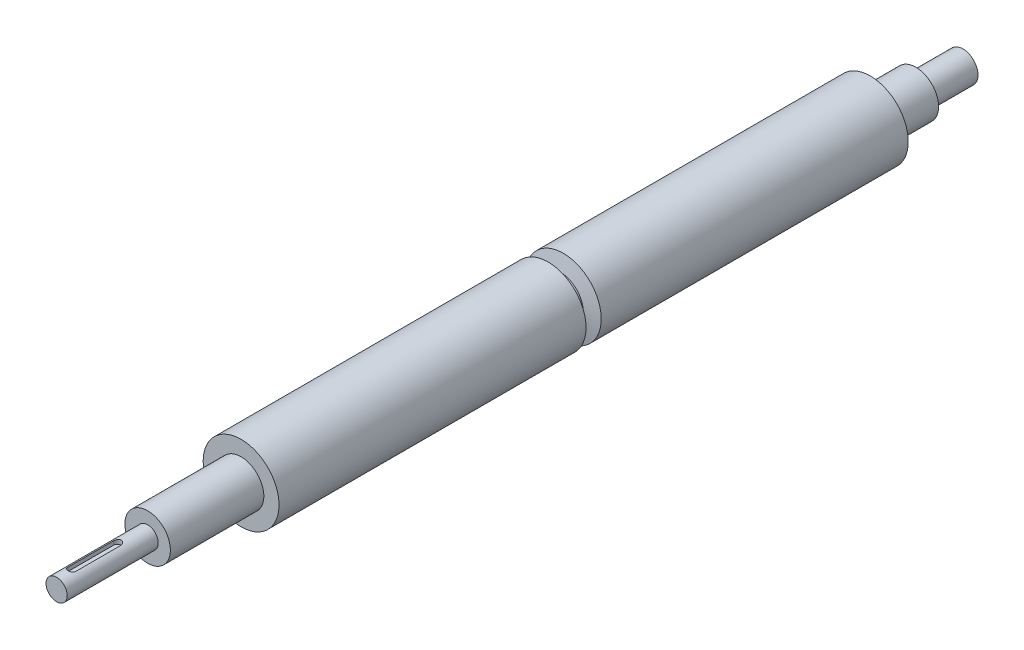
ISO-10303-21;
HEADER;
FILE_DESCRIPTION(('STEP AP214'),'2;1');
FILE_NAME('part.step','',(''),(''),'','','');
FILE_SCHEMA(('AUTOMOTIVE_DESIGN { 1 0 10303 214 1 1 1 1 }'));
ENDSEC;
DATA;
#1=APPLICATION_CONTEXT('core data for automotive mechanical design processes');
#2=APPLICATION_PROTOCOL_DEFINITION('international standard','automotive_design',2000,#1);
#3=PRODUCT_CONTEXT('',#1,'mechanical');
#4=PRODUCT('Part','Part','',(#3));
#5=PRODUCT_RELATED_PRODUCT_CATEGORY('part','',(#4));
#6=PRODUCT_DEFINITION_FORMATION('','',#4);
#7=PRODUCT_DEFINITION_CONTEXT('part definition',#1,'design');
#8=PRODUCT_DEFINITION('design','',#6,#7);
#9=PRODUCT_DEFINITION_SHAPE('','',#8);
#10=(LENGTH_UNIT() NAMED_UNIT(*) SI_UNIT(.MILLI.,.METRE.));
#11=(NAMED_UNIT(*) PLANE_ANGLE_UNIT() SI_UNIT($,.RADIAN.));
#12=(NAMED_UNIT(*) SI_UNIT($,.STERADIAN.) SOLID_ANGLE_UNIT());
#13=UNCERTAINTY_MEASURE_WITH_UNIT(LENGTH_MEASURE(1.E-05),#10,'distance_accuracy_value','');
#14=(GEOMETRIC_REPRESENTATION_CONTEXT(3) GLOBAL_UNCERTAINTY_ASSIGNED_CONTEXT((#13)) GLOBAL_UNIT_ASSIGNED_CONTEXT((#10,
#11,#12)) REPRESENTATION_CONTEXT('',''));
#15=CARTESIAN_POINT('',(0.,0.,0.));
#16=DIRECTION('',(0.,0.,1.));
#17=DIRECTION('',(1.,0.,0.));
#18=AXIS2_PLACEMENT_3D('',#15,#16,#17);
#19=CARTESIAN_POINT('',(0.,0.,-476.4));
#20=DIRECTION('',(0.,0.,1.));
#21=DIRECTION('',(1.,0.,0.));
#22=AXIS2_PLACEMENT_3D('',#19,#20,#21);
#23=CYLINDRICAL_SURFACE('',#22,25.);
#24=CARTESIAN_POINT('',(0.,0.,-264.));
#25=DIRECTION('',(0.,0.,1.));
#26=DIRECTION('',(1.,0.,0.));
#27=AXIS2_PLACEMENT_3D('',#24,#25,#26);
#28=CIRCLE('',#27,25.);
#29=CARTESIAN_POINT('',(25.,0.,-264.));
#30=VERTEX_POINT('',#29);
#31=EDGE_CURVE('E211',#30,#30,#28,.T.);
#32=ORIENTED_EDGE('',*,*,#31,.T.);
#33=EDGE_LOOP('',(#32));
#34=FACE_BOUND('',#33,.T.);
#35=CARTESIAN_POINT('',(0.,0.,-61.6));
#36=DIRECTION('',(0.,0.,-1.));
#37=DIRECTION('',(-1.,0.,0.));
#38=AXIS2_PLACEMENT_3D('',#35,#36,#37);
#39=CIRCLE('',#38,25.);
#40=CARTESIAN_POINT('',(-25.,0.,-61.6));
#41=VERTEX_POINT('',#40);
#42=EDGE_CURVE('E118',#41,#41,#39,.T.);
#43=ORIENTED_EDGE('',*,*,#42,.T.);
#44=EDGE_LOOP('',(#43));
#45=FACE_BOUND('',#44,.T.);
#46=ADVANCED_FACE('F33',(#34,#45),#23,.T.);
#47=CARTESIAN_POINT('',(0.,0.,60.));
#48=DIRECTION('',(0.,0.,-1.));
#49=DIRECTION('',(-1.,0.,0.));
#50=AXIS2_PLACEMENT_3D('',#47,#48,#49);
#51=CYLINDRICAL_SURFACE('',#50,7.);
#52=DIRECTION('',(0.,0.,-1.));
#53=VECTOR('',#52,1.);
#54=CARTESIAN_POINT('',(-2.5,6.53834841531101,60.));
#55=LINE('',#54,#53);
#56=CARTESIAN_POINT('',(-2.5,6.53834841531101,50.));
#57=VERTEX_POINT('',#56);
#58=CARTESIAN_POINT('',(-2.5,6.53834841531101,20.));
#59=VERTEX_POINT('',#58);
#60=EDGE_CURVE('E11',#57,#59,#55,.T.);
#61=ORIENTED_EDGE('',*,*,#60,.T.);
#62=CARTESIAN_POINT('',(-2.5,6.53834841531101,20.));
#63=CARTESIAN_POINT('',(-2.50000932220903,6.53833653785133,19.9321107542711));
#64=CARTESIAN_POINT('',(-2.49723485076694,6.53940549922738,19.8642280673609));
#65=CARTESIAN_POINT('',(-2.4861910211816,6.54361657478134,19.7289960893886));
#66=CARTESIAN_POINT('',(-2.47792334551208,6.54675805418062,19.6616466413939));
#67=CARTESIAN_POINT('',(-2.456001752859,6.55501217637942,19.5281785853972));
#68=CARTESIAN_POINT('',(-2.44236559963955,6.56011831705676,19.4620566636602));
#69=CARTESIAN_POINT('',(-2.40985115466648,6.57213177854175,19.3312981648915));
#70=CARTESIAN_POINT('',(-2.39097263107435,6.57903917900746,19.2666616536876));
#71=CARTESIAN_POINT('',(-2.32673964179205,6.6021493436571,19.0757356335225));
#72=CARTESIAN_POINT('',(-2.27375112606986,6.62075475340845,18.9522095478644));
#73=CARTESIAN_POINT('',(-2.14910757865425,6.6622539736071,18.715769666872));
#74=CARTESIAN_POINT('',(-2.07743895048849,6.68515090424876,18.6028636832645));
#75=CARTESIAN_POINT('',(-1.9140257110197,6.73379913792224,18.3857847866473));
#76=CARTESIAN_POINT('',(-1.82158337146743,6.75962864041371,18.2821535248041));
#77=CARTESIAN_POINT('',(-1.6207338877633,6.81057592323031,18.0914912952836));
#78=CARTESIAN_POINT('',(-1.51232377552673,6.83569357019868,18.0044634207566));
#79=CARTESIAN_POINT('',(-1.27853915335934,6.88331133279046,17.846910144545));
#80=CARTESIAN_POINT('',(-1.15274833789185,6.90570835223797,17.7769684781395));
#81=CARTESIAN_POINT('',(-0.890250825476634,6.94442357672633,17.6594633532026));
#82=CARTESIAN_POINT('',(-0.753547890540327,6.96074386585466,17.611892220954));
#83=CARTESIAN_POINT('',(-0.478829979256175,6.98491050510711,17.5423593978176));
#84=CARTESIAN_POINT('',(-0.341079835227467,6.99306594352515,17.5194608695289));
#85=CARTESIAN_POINT('',(-0.0634643052969047,7.00108798053822,17.4969315972224));
#86=CARTESIAN_POINT('',(0.0764004845074471,7.00095687302702,17.4972944139653));
#87=CARTESIAN_POINT('',(0.347593258486945,6.99262258049077,17.5207112737611));
#88=CARTESIAN_POINT('',(0.47902240707872,6.98478243583517,17.5427447941985));
#89=CARTESIAN_POINT('',(0.736175812143607,6.96237832507347,17.6071734241588));
#90=CARTESIAN_POINT('',(0.861899745780463,6.94781397899037,17.6495696843625));
#91=CARTESIAN_POINT('',(1.10616102429807,6.91316506890369,17.7540469115653));
#92=CARTESIAN_POINT('',(1.22457279066906,6.89300592164314,17.8163957149601));
#93=CARTESIAN_POINT('',(1.44953531305523,6.84923355616321,17.9587793352234));
#94=CARTESIAN_POINT('',(1.5560824517677,6.82561928959263,18.0388195237836));
#95=CARTESIAN_POINT('',(1.7603244525607,6.7759054780549,18.2193232636567));
#96=CARTESIAN_POINT('',(1.85724185700418,6.74974055843875,18.3206497231449));
#97=CARTESIAN_POINT('',(2.03299914621296,6.69890342468975,18.5383273641656));
#98=CARTESIAN_POINT('',(2.11183255456462,6.67423174765257,18.6546839051685));
#99=CARTESIAN_POINT('',(2.25049860898459,6.62877803875405,18.901942598522));
#100=CARTESIAN_POINT('',(2.30994207989625,6.60807875118994,19.0330789755054));
#101=CARTESIAN_POINT('',(2.4055543972585,6.57388213610267,19.3043648015822));
#102=CARTESIAN_POINT('',(2.44176119399954,6.56037307165054,19.444499141169));
#103=CARTESIAN_POINT('',(2.47705497148627,6.54708542245562,19.6550305442642));
#104=CARTESIAN_POINT('',(2.48565347586445,6.54382010967907,19.7237363017718));
#105=CARTESIAN_POINT('',(2.49712352174882,6.53944910829676,19.8616151641917));
#106=CARTESIAN_POINT('',(2.50000139665367,6.53834103140935,19.9307876671005));
#107=CARTESIAN_POINT('',(2.5,6.53834841531101,20.));
#108=B_SPLINE_CURVE_WITH_KNOTS('',3,(#62,#63,#64,#65,#66,#67,#68,#69,#70,#71,#72,#73,#74,#75,
#76,#77,#78,#79,#80,#81,#82,#83,#84,#85,#86,#87,#88,#89,#90,#91,#92,#93,#94,#95,#96,#97,#98,#99,
#100,#101,#102,#103,#104,#105,#106,#107),.UNSPECIFIED.,.F.,.F.,(4,2,2,2,2,2,2,2,2,2,2,2,2,2,2,2,
2,2,2,2,2,2,4),(0.,0.203591628551589,0.407120929225528,0.609982356545741,0.812852756635989,
1.21793118555512,1.6233052814847,2.0451597231193,2.4670926781184,2.90188398965561,
3.33652604665238,3.75400993940861,4.17137826416922,4.56998920861347,4.96862268086888,
5.37284909448639,5.77719841367921,6.20315837945088,6.6292706567472,7.06347329058504,
7.49696496492444,7.70468580162772,7.91217653896403),.UNSPECIFIED.);
#109=CARTESIAN_POINT('',(2.5,6.53834841531101,20.));
#110=VERTEX_POINT('',#109);
#111=EDGE_CURVE('E138',#59,#110,#108,.T.);
#112=ORIENTED_EDGE('',*,*,#111,.T.);
#113=DIRECTION('',(0.,0.,-1.));
#114=VECTOR('',#113,1.);
#115=CARTESIAN_POINT('',(2.5,6.53834841531101,60.));
#116=LINE('',#115,#114);
#117=CARTESIAN_POINT('',(2.5,6.53834841531101,50.));
#118=VERTEX_POINT('',#117);
#119=EDGE_CURVE('E42',#110,#118,#116,.F.);
#120=ORIENTED_EDGE('',*,*,#119,.T.);
#121=CARTESIAN_POINT('',(2.5,6.53834841531101,50.));
#122=CARTESIAN_POINT('',(2.50000932220903,6.53833653785133,50.0678892457289));
#123=CARTESIAN_POINT('',(2.49723485076694,6.53940549922738,50.1357719326391));
#124=CARTESIAN_POINT('',(2.4861910211816,6.54361657478134,50.2710039106114));
#125=CARTESIAN_POINT('',(2.47792334551208,6.54675805418063,50.3383533586061));
#126=CARTESIAN_POINT('',(2.456001752859,6.55501217637942,50.4718214146028));
#127=CARTESIAN_POINT('',(2.44236559963955,6.56011831705676,50.5379433363398));
#128=CARTESIAN_POINT('',(2.40985115466648,6.57213177854175,50.6687018351085));
#129=CARTESIAN_POINT('',(2.39097263107435,6.57903917900746,50.7333383463124));
#130=CARTESIAN_POINT('',(2.32673964179204,6.6021493436571,50.9242643664775));
#131=CARTESIAN_POINT('',(2.27375112606986,6.62075475340845,51.0477904521356));
#132=CARTESIAN_POINT('',(2.14910757865425,6.6622539736071,51.284230333128));
#133=CARTESIAN_POINT('',(2.07743895048849,6.68515090424876,51.3971363167355));
#134=CARTESIAN_POINT('',(1.9140257110197,6.73379913792224,51.6142152133527));
#135=CARTESIAN_POINT('',(1.82158337146744,6.75962864041371,51.7178464751959));
#136=CARTESIAN_POINT('',(1.6207338877633,6.81057592323031,51.9085087047164));
#137=CARTESIAN_POINT('',(1.51232377552674,6.83569357019868,51.9955365792433));
#138=CARTESIAN_POINT('',(1.27853915335934,6.88331133279046,52.153089855455));
#139=CARTESIAN_POINT('',(1.15274833789185,6.90570835223797,52.2230315218605));
#140=CARTESIAN_POINT('',(0.890250825476638,6.94442357672633,52.3405366467974));
#141=CARTESIAN_POINT('',(0.753547890540329,6.96074386585465,52.388107779046));
#142=CARTESIAN_POINT('',(0.478829979256177,6.98491050510711,52.4576406021824));
#143=CARTESIAN_POINT('',(0.341079835227468,6.99306594352515,52.4805391304711));
#144=CARTESIAN_POINT('',(0.0634643052969047,7.00108798053822,52.5030684027776));
#145=CARTESIAN_POINT('',(-0.0764004845074475,7.00095687302702,52.5027055860347));
#146=CARTESIAN_POINT('',(-0.347593258486945,6.99262258049077,52.4792887262389));
#147=CARTESIAN_POINT('',(-0.47902240707872,6.98478243583517,52.4572552058015));
#148=CARTESIAN_POINT('',(-0.736175812143607,6.96237832507347,52.3928265758412));
#149=CARTESIAN_POINT('',(-0.861899745780463,6.94781397899037,52.3504303156375));
#150=CARTESIAN_POINT('',(-1.10616102429807,6.91316506890369,52.2459530884347));
#151=CARTESIAN_POINT('',(-1.22457279066906,6.89300592164314,52.1836042850399));
#152=CARTESIAN_POINT('',(-1.44953531305524,6.84923355616321,52.0412206647766));
#153=CARTESIAN_POINT('',(-1.5560824517677,6.82561928959263,51.9611804762164));
#154=CARTESIAN_POINT('',(-1.7603244525607,6.7759054780549,51.7806767363433));
#155=CARTESIAN_POINT('',(-1.85724185700418,6.74974055843875,51.6793502768551));
#156=CARTESIAN_POINT('',(-2.03299914621296,6.69890342468975,51.4616726358344));
#157=CARTESIAN_POINT('',(-2.11183255456462,6.67423174765257,51.3453160948315));
#158=CARTESIAN_POINT('',(-2.25049860898459,6.62877803875405,51.098057401478));
#159=CARTESIAN_POINT('',(-2.30994207989625,6.60807875118994,50.9669210244946));
#160=CARTESIAN_POINT('',(-2.4055543972585,6.57388213610267,50.6956351984178));
#161=CARTESIAN_POINT('',(-2.44176119399954,6.56037307165054,50.555500858831));
#162=CARTESIAN_POINT('',(-2.47705497148627,6.54708542245562,50.3449694557358));
#163=CARTESIAN_POINT('',(-2.48565347586445,6.54382010967907,50.2762636982282));
#164=CARTESIAN_POINT('',(-2.49712352174882,6.53944910829676,50.1383848358083));
#165=CARTESIAN_POINT('',(-2.50000139665367,6.53834103140935,50.0692123328995));
#166=CARTESIAN_POINT('',(-2.5,6.53834841531101,50.));
#167=B_SPLINE_CURVE_WITH_KNOTS('',3,(#121,#122,#123,#124,#125,#126,#127,#128,#129,#130,#131,
#132,#133,#134,#135,#136,#137,#138,#139,#140,#141,#142,#143,#144,#145,#146,#147,#148,#149,#150,
#151,#152,#153,#154,#155,#156,#157,#158,#159,#160,#161,#162,#163,#164,#165,#166),.UNSPECIFIED.,
.F.,.F.,(4,2,2,2,2,2,2,2,2,2,2,2,2,2,2,2,2,2,2,2,2,2,4),(0.,0.203591628551592,0.407120929225535,
0.609982356545748,0.812852756635989,1.21793118555513,1.6233052814847,2.0451597231193,
2.4670926781184,2.9018839896556,3.33652604665237,3.75400993940861,4.17137826416922,
4.56998920861347,4.96862268086888,5.37284909448639,5.77719841367921,6.20315837945088,
6.6292706567472,7.06347329058504,7.49696496492444,7.70468580162773,7.91217653896404),.UNSPECIFIED.);
#168=EDGE_CURVE('E49',#118,#57,#167,.T.);
#169=ORIENTED_EDGE('',*,*,#168,.T.);
#170=EDGE_LOOP('',(#61,#112,#120,#169));
#171=FACE_BOUND('',#170,.T.);
#172=CARTESIAN_POINT('',(0.,0.,60.));
#173=DIRECTION('',(0.,0.,1.));
#174=DIRECTION('',(1.,0.,0.));
#175=AXIS2_PLACEMENT_3D('',#172,#173,#174);
#176=CIRCLE('',#175,7.);
#177=CARTESIAN_POINT('',(7.,0.,60.));
#178=VERTEX_POINT('',#177);
#179=EDGE_CURVE('E135',#178,#178,#176,.T.);
#180=ORIENTED_EDGE('',*,*,#179,.F.);
#181=EDGE_LOOP('',(#180));
#182=FACE_BOUND('',#181,.T.);
#183=CARTESIAN_POINT('',(0.,0.,0.));
#184=DIRECTION('',(0.,0.,-1.));
#185=DIRECTION('',(-1.,0.,0.));
#186=AXIS2_PLACEMENT_3D('',#183,#184,#185);
#187=CIRCLE('',#186,7.);
#188=CARTESIAN_POINT('',(-7.,0.,0.));
#189=VERTEX_POINT('',#188);
#190=EDGE_CURVE('E130',#189,#189,#187,.T.);
#191=ORIENTED_EDGE('',*,*,#190,.F.);
#192=EDGE_LOOP('',(#191));
#193=FACE_BOUND('',#192,.T.);
#194=ADVANCED_FACE('F35',(#171,#182,#193),#51,.T.);
#195=CARTESIAN_POINT('',(0.,0.,60.));
#196=DIRECTION('',(0.,0.,1.));
#197=DIRECTION('',(1.,0.,0.));
#198=AXIS2_PLACEMENT_3D('',#195,#196,#197);
#199=PLANE('',#198);
#200=ORIENTED_EDGE('',*,*,#179,.T.);
#201=EDGE_LOOP('',(#200));
#202=FACE_BOUND('',#201,.T.);
#203=ADVANCED_FACE('F194',(#202),#199,.T.);
#204=CARTESIAN_POINT('',(0.,0.,0.));
#205=DIRECTION('',(0.,0.,-1.));
#206=DIRECTION('',(-1.,0.,0.));
#207=AXIS2_PLACEMENT_3D('',#204,#205,#206);
#208=PLANE('',#207);
#209=CARTESIAN_POINT('',(0.,0.,0.));
#210=DIRECTION('',(0.,0.,-1.));
#211=DIRECTION('',(-1.,0.,0.));
#212=AXIS2_PLACEMENT_3D('',#209,#210,#211);
#213=CIRCLE('',#212,15.);
#214=CARTESIAN_POINT('',(-15.,0.,0.));
#215=VERTEX_POINT('',#214);
#216=EDGE_CURVE('E124',#215,#215,#213,.T.);
#217=ORIENTED_EDGE('',*,*,#216,.F.);
#218=EDGE_LOOP('',(#217));
#219=FACE_BOUND('',#218,.T.);
#220=ORIENTED_EDGE('',*,*,#190,.T.);
#221=EDGE_LOOP('',(#220));
#222=FACE_BOUND('',#221,.T.);
#223=ADVANCED_FACE('F191',(#219,#222),#208,.F.);
#224=CARTESIAN_POINT('',(0.,0.,-61.6));
#225=DIRECTION('',(0.,0.,1.));
#226=DIRECTION('',(1.,0.,0.));
#227=AXIS2_PLACEMENT_3D('',#224,#225,#226);
#228=CYLINDRICAL_SURFACE('',#227,15.);
#229=CARTESIAN_POINT('',(0.,0.,-61.6));
#230=DIRECTION('',(0.,0.,-1.));
#231=DIRECTION('',(-1.,0.,0.));
#232=AXIS2_PLACEMENT_3D('',#229,#230,#231);
#233=CIRCLE('',#232,15.);
#234=CARTESIAN_POINT('',(-15.,0.,-61.6));
#235=VERTEX_POINT('',#234);
#236=EDGE_CURVE('E127',#235,#235,#233,.T.);
#237=ORIENTED_EDGE('',*,*,#236,.F.);
#238=EDGE_LOOP('',(#237));
#239=FACE_BOUND('',#238,.T.);
#240=ORIENTED_EDGE('',*,*,#216,.T.);
#241=EDGE_LOOP('',(#240));
#242=FACE_BOUND('',#241,.T.);
#243=ADVANCED_FACE('F186',(#239,#242),#228,.T.);
#244=CARTESIAN_POINT('',(0.,0.,-61.6));
#245=DIRECTION('',(0.,0.,-1.));
#246=DIRECTION('',(-1.,0.,0.));
#247=AXIS2_PLACEMENT_3D('',#244,#245,#246);
#248=PLANE('',#247);
#249=ORIENTED_EDGE('',*,*,#42,.F.);
#250=EDGE_LOOP('',(#249));
#251=FACE_BOUND('',#250,.T.);
#252=ORIENTED_EDGE('',*,*,#236,.T.);
#253=EDGE_LOOP('',(#252));
#254=FACE_BOUND('',#253,.T.);
#255=ADVANCED_FACE('F161',(#251,#254),#248,.F.);
#256=CARTESIAN_POINT('',(0.,4.04,50.));
#257=DIRECTION('',(0.,1.,0.));
#258=DIRECTION('',(0.,0.,1.));
#259=AXIS2_PLACEMENT_3D('',#256,#257,#258);
#260=CYLINDRICAL_SURFACE('',#259,2.5);
#261=DIRECTION('',(0.,1.,0.));
#262=VECTOR('',#261,1.);
#263=CARTESIAN_POINT('',(2.5,4.04,50.));
#264=LINE('',#263,#262);
#265=CARTESIAN_POINT('',(2.5,4.04,50.));
#266=VERTEX_POINT('',#265);
#267=EDGE_CURVE('E72',#266,#118,#264,.T.);
#268=ORIENTED_EDGE('',*,*,#267,.F.);
#269=CARTESIAN_POINT('',(0.,4.04,50.));
#270=DIRECTION('',(0.,1.,0.));
#271=DIRECTION('',(0.,0.,1.));
#272=AXIS2_PLACEMENT_3D('',#269,#270,#271);
#273=CIRCLE('',#272,2.5);
#274=CARTESIAN_POINT('',(-2.5,4.04,50.));
#275=VERTEX_POINT('',#274);
#276=EDGE_CURVE('E76',#275,#266,#273,.T.);
#277=ORIENTED_EDGE('',*,*,#276,.F.);
#278=DIRECTION('',(0.,1.,0.));
#279=VECTOR('',#278,1.);
#280=CARTESIAN_POINT('',(-2.5,4.04,50.));
#281=LINE('',#280,#279);
#282=EDGE_CURVE('E103',#275,#57,#281,.T.);
#283=ORIENTED_EDGE('',*,*,#282,.T.);
#284=ORIENTED_EDGE('',*,*,#168,.F.);
#285=EDGE_LOOP('',(#268,#277,#283,#284));
#286=FACE_BOUND('',#285,.T.);
#287=ADVANCED_FACE('F74',(#286),#260,.F.);
#288=CARTESIAN_POINT('',(-2.5,4.04,50.));
#289=DIRECTION('',(-1.,0.,0.));
#290=DIRECTION('',(0.,0.,1.));
#291=AXIS2_PLACEMENT_3D('',#288,#289,#290);
#292=PLANE('',#291);
#293=ORIENTED_EDGE('',*,*,#282,.F.);
#294=DIRECTION('',(0.,0.,1.));
#295=VECTOR('',#294,1.);
#296=CARTESIAN_POINT('',(-2.5,4.04,50.));
#297=LINE('',#296,#295);
#298=CARTESIAN_POINT('',(-2.5,4.04,20.));
#299=VERTEX_POINT('',#298);
#300=EDGE_CURVE('E81',#299,#275,#297,.T.);
#301=ORIENTED_EDGE('',*,*,#300,.F.);
#302=DIRECTION('',(0.,1.,0.));
#303=VECTOR('',#302,1.);
#304=CARTESIAN_POINT('',(-2.5,4.04,20.));
#305=LINE('',#304,#303);
#306=EDGE_CURVE('E106',#299,#59,#305,.T.);
#307=ORIENTED_EDGE('',*,*,#306,.T.);
#308=ORIENTED_EDGE('',*,*,#60,.F.);
#309=EDGE_LOOP('',(#293,#301,#307,#308));
#310=FACE_BOUND('',#309,.T.);
#311=ADVANCED_FACE('F154',(#310),#292,.F.);
#312=CARTESIAN_POINT('',(0.,4.04,20.));
#313=DIRECTION('',(0.,1.,0.));
#314=DIRECTION('',(0.,0.,1.));
#315=AXIS2_PLACEMENT_3D('',#312,#313,#314);
#316=CYLINDRICAL_SURFACE('',#315,2.5);
#317=ORIENTED_EDGE('',*,*,#306,.F.);
#318=CARTESIAN_POINT('',(0.,4.04,20.));
#319=DIRECTION('',(0.,1.,0.));
#320=DIRECTION('',(0.,0.,1.));
#321=AXIS2_PLACEMENT_3D('',#318,#319,#320);
#322=CIRCLE('',#321,2.5);
#323=CARTESIAN_POINT('',(2.5,4.04,20.));
#324=VERTEX_POINT('',#323);
#325=EDGE_CURVE('E90',#324,#299,#322,.T.);
#326=ORIENTED_EDGE('',*,*,#325,.F.);
#327=DIRECTION('',(0.,1.,0.));
#328=VECTOR('',#327,1.);
#329=CARTESIAN_POINT('',(2.5,4.04,20.));
#330=LINE('',#329,#328);
#331=EDGE_CURVE('E80',#324,#110,#330,.T.);
#332=ORIENTED_EDGE('',*,*,#331,.T.);
#333=ORIENTED_EDGE('',*,*,#111,.F.);
#334=EDGE_LOOP('',(#317,#326,#332,#333));
#335=FACE_BOUND('',#334,.T.);
#336=ADVANCED_FACE('F149',(#335),#316,.F.);
#337=CARTESIAN_POINT('',(2.5,4.04,50.));
#338=DIRECTION('',(1.,0.,0.));
#339=DIRECTION('',(0.,0.,-1.));
#340=AXIS2_PLACEMENT_3D('',#337,#338,#339);
#341=PLANE('',#340);
#342=ORIENTED_EDGE('',*,*,#331,.F.);
#343=DIRECTION('',(0.,0.,-1.));
#344=VECTOR('',#343,1.);
#345=CARTESIAN_POINT('',(2.5,4.04,50.));
#346=LINE('',#345,#344);
#347=EDGE_CURVE('E84',#266,#324,#346,.T.);
#348=ORIENTED_EDGE('',*,*,#347,.F.);
#349=ORIENTED_EDGE('',*,*,#267,.T.);
#350=ORIENTED_EDGE('',*,*,#119,.F.);
#351=EDGE_LOOP('',(#342,#348,#349,#350));
#352=FACE_BOUND('',#351,.T.);
#353=ADVANCED_FACE('F85',(#352),#341,.F.);
#354=CARTESIAN_POINT('',(0.,4.04,50.));
#355=DIRECTION('',(0.,1.,0.));
#356=DIRECTION('',(0.,0.,1.));
#357=AXIS2_PLACEMENT_3D('',#354,#355,#356);
#358=PLANE('',#357);
#359=ORIENTED_EDGE('',*,*,#276,.T.);
#360=ORIENTED_EDGE('',*,*,#347,.T.);
#361=ORIENTED_EDGE('',*,*,#325,.T.);
#362=ORIENTED_EDGE('',*,*,#300,.T.);
#363=EDGE_LOOP('',(#359,#360,#361,#362));
#364=FACE_BOUND('',#363,.T.);
#365=ADVANCED_FACE('F92',(#364),#358,.T.);
#366=CARTESIAN_POINT('',(0.,0.,-266.));
#367=DIRECTION('',(0.,0.,1.));
#368=DIRECTION('',(1.,0.,0.));
#369=AXIS2_PLACEMENT_3D('',#366,#367,#368);
#370=CONICAL_SURFACE('',#369,15.2020410288673,1.36943840600457);
#371=ORIENTED_EDGE('',*,*,#31,.F.);
#372=EDGE_LOOP('',(#371));
#373=FACE_BOUND('',#372,.T.);
#374=CARTESIAN_POINT('',(0.,0.,-266.));
#375=DIRECTION('',(0.,0.,1.));
#376=DIRECTION('',(1.,0.,0.));
#377=AXIS2_PLACEMENT_3D('',#374,#375,#376);
#378=CIRCLE('',#377,15.2020410288673);
#379=CARTESIAN_POINT('',(15.2020410288673,0.,-266.));
#380=VERTEX_POINT('',#379);
#381=EDGE_CURVE('E94',#380,#380,#378,.T.);
#382=ORIENTED_EDGE('',*,*,#381,.T.);
#383=EDGE_LOOP('',(#382));
#384=FACE_BOUND('',#383,.T.);
#385=ADVANCED_FACE('F242',(#373,#384),#370,.T.);
#386=CARTESIAN_POINT('',(0.,0.,0.));
#387=DIRECTION('',(0.,0.,1.));
#388=DIRECTION('',(1.,0.,0.));
#389=AXIS2_PLACEMENT_3D('',#386,#387,#388);
#390=CYLINDRICAL_SURFACE('',#389,15.2020410288673);
#391=ORIENTED_EDGE('',*,*,#381,.F.);
#392=EDGE_LOOP('',(#391));
#393=FACE_BOUND('',#392,.T.);
#394=CARTESIAN_POINT('',(0.,0.,-272.));
#395=DIRECTION('',(0.,0.,1.));
#396=DIRECTION('',(1.,0.,0.));
#397=AXIS2_PLACEMENT_3D('',#394,#395,#396);
#398=CIRCLE('',#397,15.2020410288673);
#399=CARTESIAN_POINT('',(15.2020410288673,0.,-272.));
#400=VERTEX_POINT('',#399);
#401=EDGE_CURVE('E97',#400,#400,#398,.T.);
#402=ORIENTED_EDGE('',*,*,#401,.T.);
#403=EDGE_LOOP('',(#402));
#404=FACE_BOUND('',#403,.T.);
#405=ADVANCED_FACE('F228',(#393,#404),#390,.T.);
#406=CARTESIAN_POINT('',(0.,0.,-274.));
#407=DIRECTION('',(0.,0.,-1.));
#408=DIRECTION('',(-1.,0.,0.));
#409=AXIS2_PLACEMENT_3D('',#406,#407,#408);
#410=CONICAL_SURFACE('',#409,25.,1.36943840600457);
#411=ORIENTED_EDGE('',*,*,#401,.F.);
#412=EDGE_LOOP('',(#411));
#413=FACE_BOUND('',#412,.T.);
#414=CARTESIAN_POINT('',(0.,0.,-274.));
#415=DIRECTION('',(0.,0.,1.));
#416=DIRECTION('',(1.,0.,0.));
#417=AXIS2_PLACEMENT_3D('',#414,#415,#416);
#418=CIRCLE('',#417,25.);
#419=CARTESIAN_POINT('',(25.,0.,-274.));
#420=VERTEX_POINT('',#419);
#421=EDGE_CURVE('E221',#420,#420,#418,.T.);
#422=ORIENTED_EDGE('',*,*,#421,.T.);
#423=EDGE_LOOP('',(#422));
#424=FACE_BOUND('',#423,.T.);
#425=ADVANCED_FACE('F166',(#413,#424),#410,.T.);
#426=CARTESIAN_POINT('',(0.,0.,-537.4));
#427=DIRECTION('',(0.,0.,-1.));
#428=DIRECTION('',(-1.,0.,0.));
#429=AXIS2_PLACEMENT_3D('',#426,#427,#428);
#430=PLANE('',#429);
#431=CARTESIAN_POINT('',(0.,0.,-537.4));
#432=DIRECTION('',(0.,0.,-1.));
#433=DIRECTION('',(-1.,0.,0.));
#434=AXIS2_PLACEMENT_3D('',#431,#432,#433);
#435=CIRCLE('',#434,10.);
#436=CARTESIAN_POINT('',(-10.,0.,-537.4));
#437=VERTEX_POINT('',#436);
#438=EDGE_CURVE('E109',#437,#437,#435,.T.);
#439=ORIENTED_EDGE('',*,*,#438,.T.);
#440=EDGE_LOOP('',(#439));
#441=FACE_BOUND('',#440,.T.);
#442=ADVANCED_FACE('F162',(#441),#430,.T.);
#443=CARTESIAN_POINT('',(0.,0.,-537.4));
#444=DIRECTION('',(0.,0.,1.));
#445=DIRECTION('',(1.,0.,0.));
#446=AXIS2_PLACEMENT_3D('',#443,#444,#445);
#447=CYLINDRICAL_SURFACE('',#446,10.);
#448=ORIENTED_EDGE('',*,*,#438,.F.);
#449=EDGE_LOOP('',(#448));
#450=FACE_BOUND('',#449,.T.);
#451=CARTESIAN_POINT('',(0.,0.,-506.4));
#452=DIRECTION('',(0.,0.,-1.));
#453=DIRECTION('',(-1.,0.,0.));
#454=AXIS2_PLACEMENT_3D('',#451,#452,#453);
#455=CIRCLE('',#454,10.);
#456=CARTESIAN_POINT('',(-10.,0.,-506.4));
#457=VERTEX_POINT('',#456);
#458=EDGE_CURVE('E105',#457,#457,#455,.T.);
#459=ORIENTED_EDGE('',*,*,#458,.T.);
#460=EDGE_LOOP('',(#459));
#461=FACE_BOUND('',#460,.T.);
#462=ADVANCED_FACE('F165',(#450,#461),#447,.T.);
#463=CARTESIAN_POINT('',(0.,0.,-506.4));
#464=DIRECTION('',(0.,0.,-1.));
#465=DIRECTION('',(-1.,0.,0.));
#466=AXIS2_PLACEMENT_3D('',#463,#464,#465);
#467=PLANE('',#466);
#468=CARTESIAN_POINT('',(0.,0.,-506.4));
#469=DIRECTION('',(0.,0.,-1.));
#470=DIRECTION('',(-1.,0.,0.));
#471=AXIS2_PLACEMENT_3D('',#468,#469,#470);
#472=CIRCLE('',#471,15.);
#473=CARTESIAN_POINT('',(-15.,0.,-506.4));
#474=VERTEX_POINT('',#473);
#475=EDGE_CURVE('E115',#474,#474,#472,.T.);
#476=ORIENTED_EDGE('',*,*,#475,.T.);
#477=EDGE_LOOP('',(#476));
#478=FACE_BOUND('',#477,.T.);
#479=ORIENTED_EDGE('',*,*,#458,.F.);
#480=EDGE_LOOP('',(#479));
#481=FACE_BOUND('',#480,.T.);
#482=ADVANCED_FACE('F170',(#478,#481),#467,.T.);
#483=CARTESIAN_POINT('',(0.,0.,-506.4));
#484=DIRECTION('',(0.,0.,1.));
#485=DIRECTION('',(1.,0.,0.));
#486=AXIS2_PLACEMENT_3D('',#483,#484,#485);
#487=CYLINDRICAL_SURFACE('',#486,15.);
#488=ORIENTED_EDGE('',*,*,#475,.F.);
#489=EDGE_LOOP('',(#488));
#490=FACE_BOUND('',#489,.T.);
#491=CARTESIAN_POINT('',(0.,0.,-476.4));
#492=DIRECTION('',(0.,0.,-1.));
#493=DIRECTION('',(-1.,0.,0.));
#494=AXIS2_PLACEMENT_3D('',#491,#492,#493);
#495=CIRCLE('',#494,15.);
#496=CARTESIAN_POINT('',(-15.,0.,-476.4));
#497=VERTEX_POINT('',#496);
#498=EDGE_CURVE('E112',#497,#497,#495,.T.);
#499=ORIENTED_EDGE('',*,*,#498,.T.);
#500=EDGE_LOOP('',(#499));
#501=FACE_BOUND('',#500,.T.);
#502=ADVANCED_FACE('F174',(#490,#501),#487,.T.);
#503=CARTESIAN_POINT('',(0.,0.,-476.4));
#504=DIRECTION('',(0.,0.,-1.));
#505=DIRECTION('',(-1.,0.,0.));
#506=AXIS2_PLACEMENT_3D('',#503,#504,#505);
#507=PLANE('',#506);
#508=CARTESIAN_POINT('',(0.,0.,-476.4));
#509=DIRECTION('',(0.,0.,-1.));
#510=DIRECTION('',(-1.,0.,0.));
#511=AXIS2_PLACEMENT_3D('',#508,#509,#510);
#512=CIRCLE('',#511,25.);
#513=CARTESIAN_POINT('',(-25.,0.,-476.4));
#514=VERTEX_POINT('',#513);
#515=EDGE_CURVE('E121',#514,#514,#512,.T.);
#516=ORIENTED_EDGE('',*,*,#515,.T.);
#517=EDGE_LOOP('',(#516));
#518=FACE_BOUND('',#517,.T.);
#519=ORIENTED_EDGE('',*,*,#498,.F.);
#520=EDGE_LOOP('',(#519));
#521=FACE_BOUND('',#520,.T.);
#522=ADVANCED_FACE('F178',(#518,#521),#507,.T.);
#523=ORIENTED_EDGE('',*,*,#421,.F.);
#524=EDGE_LOOP('',(#523));
#525=FACE_BOUND('',#524,.T.);
#526=ORIENTED_EDGE('',*,*,#515,.F.);
#527=EDGE_LOOP('',(#526));
#528=FACE_BOUND('',#527,.T.);
#529=ADVANCED_FACE('F182',(#525,#528),#23,.T.);
#530=CLOSED_SHELL('',(#46,#194,#203,#223,#243,#255,#287,#311,#336,#353,#365,#385,#405,#425,#442,
#462,#482,#502,#522,#529));
#531=MANIFOLD_SOLID_BREP('B2',#530);
#532=ADVANCED_BREP_SHAPE_REPRESENTATION('',(#18,#531),#14);
#533=SHAPE_DEFINITION_REPRESENTATION(#9,#532);
ENDSEC;
END-ISO-10303-21;
